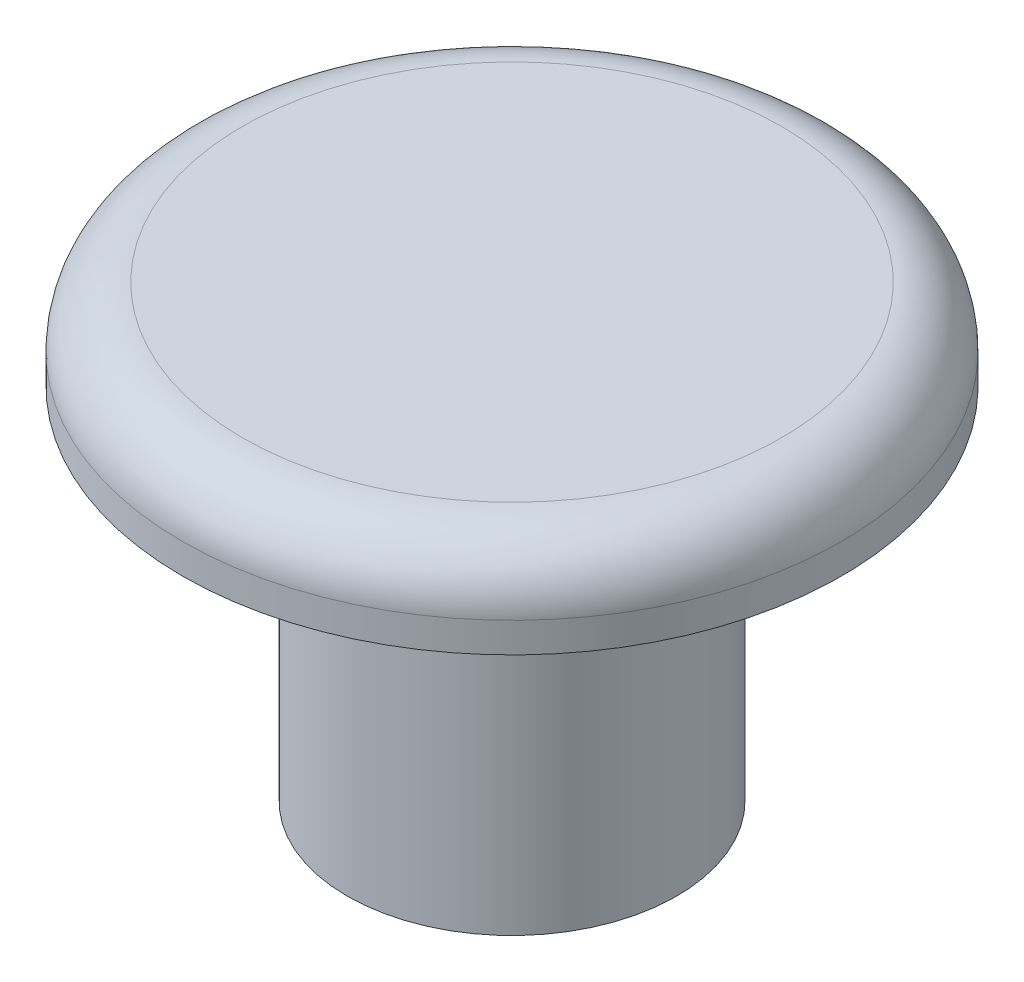
ISO-10303-21;
HEADER;
FILE_DESCRIPTION(('STEP AP214'),'2;1');
FILE_NAME('part.step','',(''),(''),'','','');
FILE_SCHEMA(('AUTOMOTIVE_DESIGN { 1 0 10303 214 1 1 1 1 }'));
ENDSEC;
DATA;
#1=APPLICATION_CONTEXT('core data for automotive mechanical design processes');
#2=APPLICATION_PROTOCOL_DEFINITION('international standard','automotive_design',2000,#1);
#3=PRODUCT_CONTEXT('',#1,'mechanical');
#4=PRODUCT('Part','Part','',(#3));
#5=PRODUCT_RELATED_PRODUCT_CATEGORY('part','',(#4));
#6=PRODUCT_DEFINITION_FORMATION('','',#4);
#7=PRODUCT_DEFINITION_CONTEXT('part definition',#1,'design');
#8=PRODUCT_DEFINITION('design','',#6,#7);
#9=PRODUCT_DEFINITION_SHAPE('','',#8);
#10=(LENGTH_UNIT() NAMED_UNIT(*) SI_UNIT(.MILLI.,.METRE.));
#11=(NAMED_UNIT(*) PLANE_ANGLE_UNIT() SI_UNIT($,.RADIAN.));
#12=(NAMED_UNIT(*) SI_UNIT($,.STERADIAN.) SOLID_ANGLE_UNIT());
#13=UNCERTAINTY_MEASURE_WITH_UNIT(LENGTH_MEASURE(1.E-05),#10,'distance_accuracy_value','');
#14=(GEOMETRIC_REPRESENTATION_CONTEXT(3) GLOBAL_UNCERTAINTY_ASSIGNED_CONTEXT((#13)) GLOBAL_UNIT_ASSIGNED_CONTEXT((#10,
#11,#12)) REPRESENTATION_CONTEXT('',''));
#15=CARTESIAN_POINT('',(0.,0.,0.));
#16=DIRECTION('',(0.,0.,1.));
#17=DIRECTION('',(1.,0.,0.));
#18=AXIS2_PLACEMENT_3D('',#15,#16,#17);
#19=CARTESIAN_POINT('',(0.,0.,0.));
#20=DIRECTION('',(0.,-1.,0.));
#21=DIRECTION('',(0.,0.,-1.));
#22=AXIS2_PLACEMENT_3D('',#19,#20,#21);
#23=PLANE('',#22);
#24=CARTESIAN_POINT('',(0.,0.,0.));
#25=DIRECTION('',(0.,1.,0.));
#26=DIRECTION('',(0.,0.,1.));
#27=AXIS2_PLACEMENT_3D('',#24,#25,#26);
#28=CIRCLE('',#27,5.5);
#29=CARTESIAN_POINT('',(0.,0.,5.5));
#30=VERTEX_POINT('',#29);
#31=EDGE_CURVE('E10',#30,#30,#28,.T.);
#32=ORIENTED_EDGE('',*,*,#31,.F.);
#33=EDGE_LOOP('',(#32));
#34=FACE_BOUND('',#33,.T.);
#35=ADVANCED_FACE('F32',(#34),#23,.T.);
#36=CARTESIAN_POINT('',(0.,0.,0.));
#37=DIRECTION('',(0.,1.,0.));
#38=DIRECTION('',(0.,0.,1.));
#39=AXIS2_PLACEMENT_3D('',#36,#37,#38);
#40=CYLINDRICAL_SURFACE('',#39,5.5);
#41=ORIENTED_EDGE('',*,*,#31,.T.);
#42=EDGE_LOOP('',(#41));
#43=FACE_BOUND('',#42,.T.);
#44=CARTESIAN_POINT('',(0.,12.,0.));
#45=DIRECTION('',(0.,1.,0.));
#46=DIRECTION('',(0.,0.,1.));
#47=AXIS2_PLACEMENT_3D('',#44,#45,#46);
#48=CIRCLE('',#47,5.5);
#49=CARTESIAN_POINT('',(0.,12.,5.5));
#50=VERTEX_POINT('',#49);
#51=EDGE_CURVE('E38',#50,#50,#48,.T.);
#52=ORIENTED_EDGE('',*,*,#51,.F.);
#53=EDGE_LOOP('',(#52));
#54=FACE_BOUND('',#53,.T.);
#55=ADVANCED_FACE('F71',(#43,#54),#40,.T.);
#56=CARTESIAN_POINT('',(-5.5,12.,0.));
#57=DIRECTION('',(0.,-1.,0.));
#58=DIRECTION('',(0.,0.,-1.));
#59=AXIS2_PLACEMENT_3D('',#56,#57,#58);
#60=PLANE('',#59);
#61=ORIENTED_EDGE('',*,*,#51,.T.);
#62=EDGE_LOOP('',(#61));
#63=FACE_BOUND('',#62,.T.);
#64=CARTESIAN_POINT('',(0.,12.,0.));
#65=DIRECTION('',(0.,1.,0.));
#66=DIRECTION('',(0.,0.,1.));
#67=AXIS2_PLACEMENT_3D('',#64,#65,#66);
#68=CIRCLE('',#67,11.);
#69=CARTESIAN_POINT('',(0.,12.,11.));
#70=VERTEX_POINT('',#69);
#71=EDGE_CURVE('E42',#70,#70,#68,.T.);
#72=ORIENTED_EDGE('',*,*,#71,.F.);
#73=EDGE_LOOP('',(#72));
#74=FACE_BOUND('',#73,.T.);
#75=ADVANCED_FACE('F67',(#63,#74),#60,.T.);
#76=CARTESIAN_POINT('',(0.,0.,0.));
#77=DIRECTION('',(0.,1.,0.));
#78=DIRECTION('',(0.,0.,1.));
#79=AXIS2_PLACEMENT_3D('',#76,#77,#78);
#80=CYLINDRICAL_SURFACE('',#79,11.);
#81=ORIENTED_EDGE('',*,*,#71,.T.);
#82=EDGE_LOOP('',(#81));
#83=FACE_BOUND('',#82,.T.);
#84=CARTESIAN_POINT('',(0.,12.9999999999987,0.));
#85=DIRECTION('',(0.,1.,0.));
#86=DIRECTION('',(0.,0.,1.));
#87=AXIS2_PLACEMENT_3D('',#84,#85,#86);
#88=CIRCLE('',#87,11.);
#89=CARTESIAN_POINT('',(0.,12.9999999999987,11.));
#90=VERTEX_POINT('',#89);
#91=EDGE_CURVE('E46',#90,#90,#88,.T.);
#92=ORIENTED_EDGE('',*,*,#91,.F.);
#93=EDGE_LOOP('',(#92));
#94=FACE_BOUND('',#93,.T.);
#95=ADVANCED_FACE('F59',(#83,#94),#80,.T.);
#96=CARTESIAN_POINT('',(0.,12.9999999999988,0.));
#97=DIRECTION('',(0.,1.,0.));
#98=DIRECTION('',(0.,0.,1.));
#99=AXIS2_PLACEMENT_3D('',#96,#97,#98);
#100=TOROIDAL_SURFACE('',#99,9.,2.);
#101=ORIENTED_EDGE('',*,*,#91,.T.);
#102=EDGE_LOOP('',(#101));
#103=FACE_BOUND('',#102,.T.);
#104=CARTESIAN_POINT('',(0.,14.9999999999988,0.));
#105=DIRECTION('',(0.,1.,0.));
#106=DIRECTION('',(0.,0.,1.));
#107=AXIS2_PLACEMENT_3D('',#104,#105,#106);
#108=CIRCLE('',#107,8.99999999999875);
#109=CARTESIAN_POINT('',(0.,14.9999999999988,8.99999999999875));
#110=VERTEX_POINT('',#109);
#111=EDGE_CURVE('E51',#110,#110,#108,.T.);
#112=ORIENTED_EDGE('',*,*,#111,.F.);
#113=EDGE_LOOP('',(#112));
#114=FACE_BOUND('',#113,.T.);
#115=ADVANCED_FACE('F57',(#103,#114),#100,.T.);
#116=CARTESIAN_POINT('',(-8.99999999999875,14.999999999996,0.));
#117=DIRECTION('',(0.,1.,0.));
#118=DIRECTION('',(0.,0.,1.));
#119=AXIS2_PLACEMENT_3D('',#116,#117,#118);
#120=PLANE('',#119);
#121=ORIENTED_EDGE('',*,*,#111,.T.);
#122=EDGE_LOOP('',(#121));
#123=FACE_BOUND('',#122,.T.);
#124=ADVANCED_FACE('F55',(#123),#120,.T.);
#125=CLOSED_SHELL('',(#35,#55,#75,#95,#115,#124));
#126=MANIFOLD_SOLID_BREP('B2',#125);
#127=ADVANCED_BREP_SHAPE_REPRESENTATION('',(#18,#126),#14);
#128=SHAPE_DEFINITION_REPRESENTATION(#9,#127);
ENDSEC;
END-ISO-10303-21;
